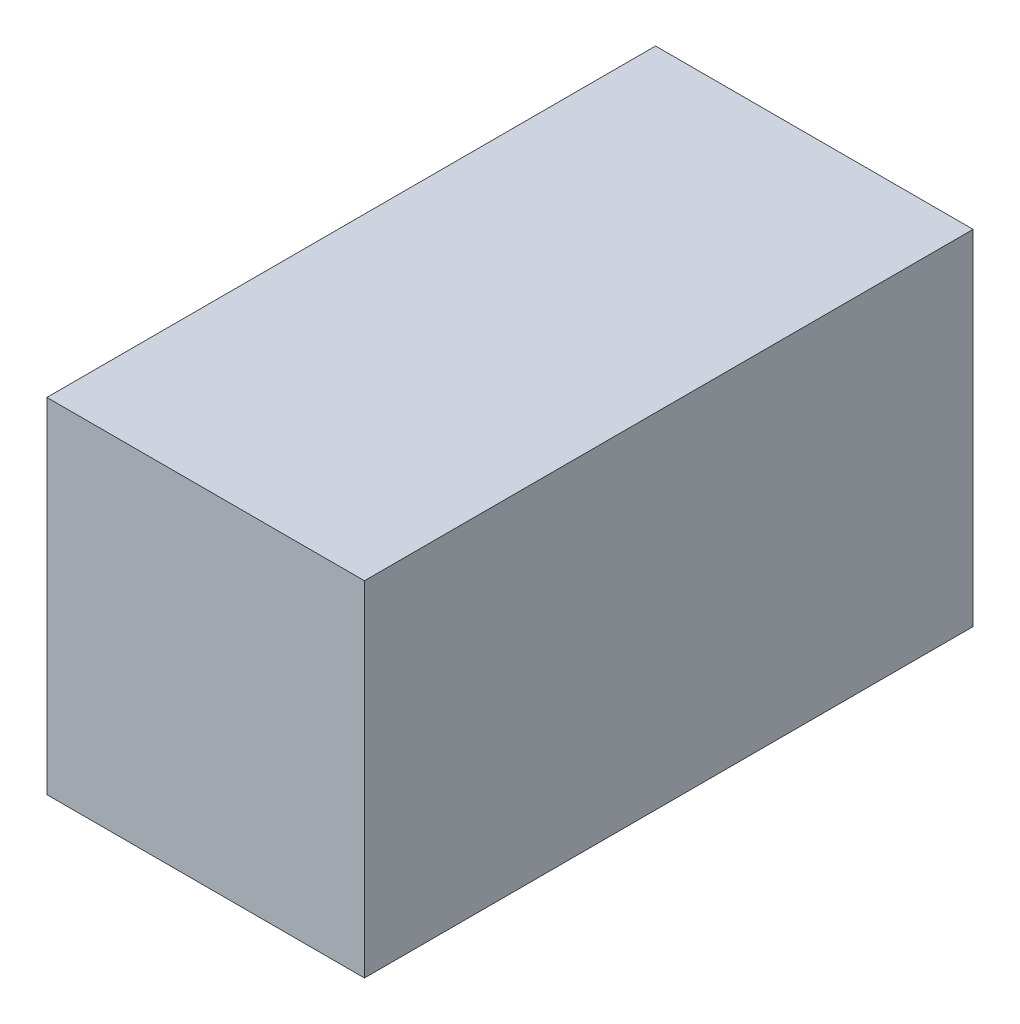
ISO-10303-21;
HEADER;
FILE_DESCRIPTION(('STEP AP214'),'2;1');
FILE_NAME('part.step','',(''),(''),'','','');
FILE_SCHEMA(('AUTOMOTIVE_DESIGN { 1 0 10303 214 1 1 1 1 }'));
ENDSEC;
DATA;
#1=APPLICATION_CONTEXT('core data for automotive mechanical design processes');
#2=APPLICATION_PROTOCOL_DEFINITION('international standard','automotive_design',2000,#1);
#3=PRODUCT_CONTEXT('',#1,'mechanical');
#4=PRODUCT('Part','Part','',(#3));
#5=PRODUCT_RELATED_PRODUCT_CATEGORY('part','',(#4));
#6=PRODUCT_DEFINITION_FORMATION('','',#4);
#7=PRODUCT_DEFINITION_CONTEXT('part definition',#1,'design');
#8=PRODUCT_DEFINITION('design','',#6,#7);
#9=PRODUCT_DEFINITION_SHAPE('','',#8);
#10=(LENGTH_UNIT() NAMED_UNIT(*) SI_UNIT(.MILLI.,.METRE.));
#11=(NAMED_UNIT(*) PLANE_ANGLE_UNIT() SI_UNIT($,.RADIAN.));
#12=(NAMED_UNIT(*) SI_UNIT($,.STERADIAN.) SOLID_ANGLE_UNIT());
#13=UNCERTAINTY_MEASURE_WITH_UNIT(LENGTH_MEASURE(1.E-05),#10,'distance_accuracy_value','');
#14=(GEOMETRIC_REPRESENTATION_CONTEXT(3) GLOBAL_UNCERTAINTY_ASSIGNED_CONTEXT((#13)) GLOBAL_UNIT_ASSIGNED_CONTEXT((#10,
#11,#12)) REPRESENTATION_CONTEXT('',''));
#15=CARTESIAN_POINT('',(0.,0.,0.));
#16=DIRECTION('',(0.,0.,1.));
#17=DIRECTION('',(1.,0.,0.));
#18=AXIS2_PLACEMENT_3D('',#15,#16,#17);
#19=CARTESIAN_POINT('',(-12.,26.,23.));
#20=DIRECTION('',(1.,0.,0.));
#21=DIRECTION('',(0.,0.,-1.));
#22=AXIS2_PLACEMENT_3D('',#19,#20,#21);
#23=PLANE('',#22);
#24=DIRECTION('',(0.,0.,1.));
#25=VECTOR('',#24,1.);
#26=CARTESIAN_POINT('',(-12.,0.,23.));
#27=LINE('',#26,#25);
#28=CARTESIAN_POINT('',(-12.,0.,-23.));
#29=VERTEX_POINT('',#28);
#30=CARTESIAN_POINT('',(-12.,0.,23.));
#31=VERTEX_POINT('',#30);
#32=EDGE_CURVE('E96',#29,#31,#27,.T.);
#33=ORIENTED_EDGE('',*,*,#32,.T.);
#34=DIRECTION('',(0.,-1.,0.));
#35=VECTOR('',#34,1.);
#36=CARTESIAN_POINT('',(-12.,26.,23.));
#37=LINE('',#36,#35);
#38=CARTESIAN_POINT('',(-12.,26.,23.));
#39=VERTEX_POINT('',#38);
#40=EDGE_CURVE('E11',#39,#31,#37,.T.);
#41=ORIENTED_EDGE('',*,*,#40,.F.);
#42=DIRECTION('',(0.,0.,1.));
#43=VECTOR('',#42,1.);
#44=CARTESIAN_POINT('',(-12.,26.,23.));
#45=LINE('',#44,#43);
#46=CARTESIAN_POINT('',(-12.,26.,-23.));
#47=VERTEX_POINT('',#46);
#48=EDGE_CURVE('E84',#47,#39,#45,.T.);
#49=ORIENTED_EDGE('',*,*,#48,.F.);
#50=DIRECTION('',(0.,-1.,0.));
#51=VECTOR('',#50,1.);
#52=CARTESIAN_POINT('',(-12.,26.,-23.));
#53=LINE('',#52,#51);
#54=EDGE_CURVE('E92',#47,#29,#53,.T.);
#55=ORIENTED_EDGE('',*,*,#54,.T.);
#56=EDGE_LOOP('',(#33,#41,#49,#55));
#57=FACE_BOUND('',#56,.T.);
#58=ADVANCED_FACE('F33',(#57),#23,.F.);
#59=CARTESIAN_POINT('',(12.,26.,23.));
#60=DIRECTION('',(0.,0.,-1.));
#61=DIRECTION('',(-1.,0.,0.));
#62=AXIS2_PLACEMENT_3D('',#59,#60,#61);
#63=PLANE('',#62);
#64=DIRECTION('',(1.,0.,0.));
#65=VECTOR('',#64,1.);
#66=CARTESIAN_POINT('',(12.,0.,23.));
#67=LINE('',#66,#65);
#68=CARTESIAN_POINT('',(12.,0.,23.));
#69=VERTEX_POINT('',#68);
#70=EDGE_CURVE('E88',#31,#69,#67,.T.);
#71=ORIENTED_EDGE('',*,*,#70,.T.);
#72=DIRECTION('',(0.,-1.,0.));
#73=VECTOR('',#72,1.);
#74=CARTESIAN_POINT('',(12.,26.,23.));
#75=LINE('',#74,#73);
#76=CARTESIAN_POINT('',(12.,26.,23.));
#77=VERTEX_POINT('',#76);
#78=EDGE_CURVE('E41',#77,#69,#75,.T.);
#79=ORIENTED_EDGE('',*,*,#78,.F.);
#80=DIRECTION('',(1.,0.,0.));
#81=VECTOR('',#80,1.);
#82=CARTESIAN_POINT('',(12.,26.,23.));
#83=LINE('',#82,#81);
#84=EDGE_CURVE('E79',#39,#77,#83,.T.);
#85=ORIENTED_EDGE('',*,*,#84,.F.);
#86=ORIENTED_EDGE('',*,*,#40,.T.);
#87=EDGE_LOOP('',(#71,#79,#85,#86));
#88=FACE_BOUND('',#87,.T.);
#89=ADVANCED_FACE('F87',(#88),#63,.F.);
#90=CARTESIAN_POINT('',(12.,26.,23.));
#91=DIRECTION('',(-1.,0.,0.));
#92=DIRECTION('',(0.,0.,1.));
#93=AXIS2_PLACEMENT_3D('',#90,#91,#92);
#94=PLANE('',#93);
#95=DIRECTION('',(0.,0.,-1.));
#96=VECTOR('',#95,1.);
#97=CARTESIAN_POINT('',(12.,0.,23.));
#98=LINE('',#97,#96);
#99=CARTESIAN_POINT('',(12.,0.,-23.));
#100=VERTEX_POINT('',#99);
#101=EDGE_CURVE('E66',#69,#100,#98,.T.);
#102=ORIENTED_EDGE('',*,*,#101,.T.);
#103=DIRECTION('',(0.,-1.,0.));
#104=VECTOR('',#103,1.);
#105=CARTESIAN_POINT('',(12.,26.,-23.));
#106=LINE('',#105,#104);
#107=CARTESIAN_POINT('',(12.,26.,-23.));
#108=VERTEX_POINT('',#107);
#109=EDGE_CURVE('E89',#108,#100,#106,.T.);
#110=ORIENTED_EDGE('',*,*,#109,.F.);
#111=DIRECTION('',(0.,0.,-1.));
#112=VECTOR('',#111,1.);
#113=CARTESIAN_POINT('',(12.,26.,23.));
#114=LINE('',#113,#112);
#115=EDGE_CURVE('E82',#77,#108,#114,.T.);
#116=ORIENTED_EDGE('',*,*,#115,.F.);
#117=ORIENTED_EDGE('',*,*,#78,.T.);
#118=EDGE_LOOP('',(#102,#110,#116,#117));
#119=FACE_BOUND('',#118,.T.);
#120=ADVANCED_FACE('F90',(#119),#94,.F.);
#121=CARTESIAN_POINT('',(12.,26.,-23.));
#122=DIRECTION('',(0.,0.,1.));
#123=DIRECTION('',(1.,0.,0.));
#124=AXIS2_PLACEMENT_3D('',#121,#122,#123);
#125=PLANE('',#124);
#126=DIRECTION('',(-1.,0.,0.));
#127=VECTOR('',#126,1.);
#128=CARTESIAN_POINT('',(12.,0.,-23.));
#129=LINE('',#128,#127);
#130=EDGE_CURVE('E72',#100,#29,#129,.T.);
#131=ORIENTED_EDGE('',*,*,#130,.T.);
#132=ORIENTED_EDGE('',*,*,#54,.F.);
#133=DIRECTION('',(-1.,0.,0.));
#134=VECTOR('',#133,1.);
#135=CARTESIAN_POINT('',(12.,26.,-23.));
#136=LINE('',#135,#134);
#137=EDGE_CURVE('E49',#108,#47,#136,.T.);
#138=ORIENTED_EDGE('',*,*,#137,.F.);
#139=ORIENTED_EDGE('',*,*,#109,.T.);
#140=EDGE_LOOP('',(#131,#132,#138,#139));
#141=FACE_BOUND('',#140,.T.);
#142=ADVANCED_FACE('F103',(#141),#125,.F.);
#143=CARTESIAN_POINT('',(0.,26.,0.));
#144=DIRECTION('',(0.,1.,0.));
#145=DIRECTION('',(0.,0.,1.));
#146=AXIS2_PLACEMENT_3D('',#143,#144,#145);
#147=PLANE('',#146);
#148=ORIENTED_EDGE('',*,*,#48,.T.);
#149=ORIENTED_EDGE('',*,*,#84,.T.);
#150=ORIENTED_EDGE('',*,*,#115,.T.);
#151=ORIENTED_EDGE('',*,*,#137,.T.);
#152=EDGE_LOOP('',(#148,#149,#150,#151));
#153=FACE_BOUND('',#152,.T.);
#154=ADVANCED_FACE('F80',(#153),#147,.T.);
#155=CARTESIAN_POINT('',(0.,0.,0.));
#156=DIRECTION('',(0.,1.,0.));
#157=DIRECTION('',(0.,0.,1.));
#158=AXIS2_PLACEMENT_3D('',#155,#156,#157);
#159=PLANE('',#158);
#160=ORIENTED_EDGE('',*,*,#32,.F.);
#161=ORIENTED_EDGE('',*,*,#130,.F.);
#162=ORIENTED_EDGE('',*,*,#101,.F.);
#163=ORIENTED_EDGE('',*,*,#70,.F.);
#164=EDGE_LOOP('',(#160,#161,#162,#163));
#165=FACE_BOUND('',#164,.T.);
#166=ADVANCED_FACE('F106',(#165),#159,.F.);
#167=CLOSED_SHELL('',(#58,#89,#120,#142,#154,#166));
#168=MANIFOLD_SOLID_BREP('B2',#167);
#169=ADVANCED_BREP_SHAPE_REPRESENTATION('',(#18,#168),#14);
#170=SHAPE_DEFINITION_REPRESENTATION(#9,#169);
ENDSEC;
END-ISO-10303-21;
